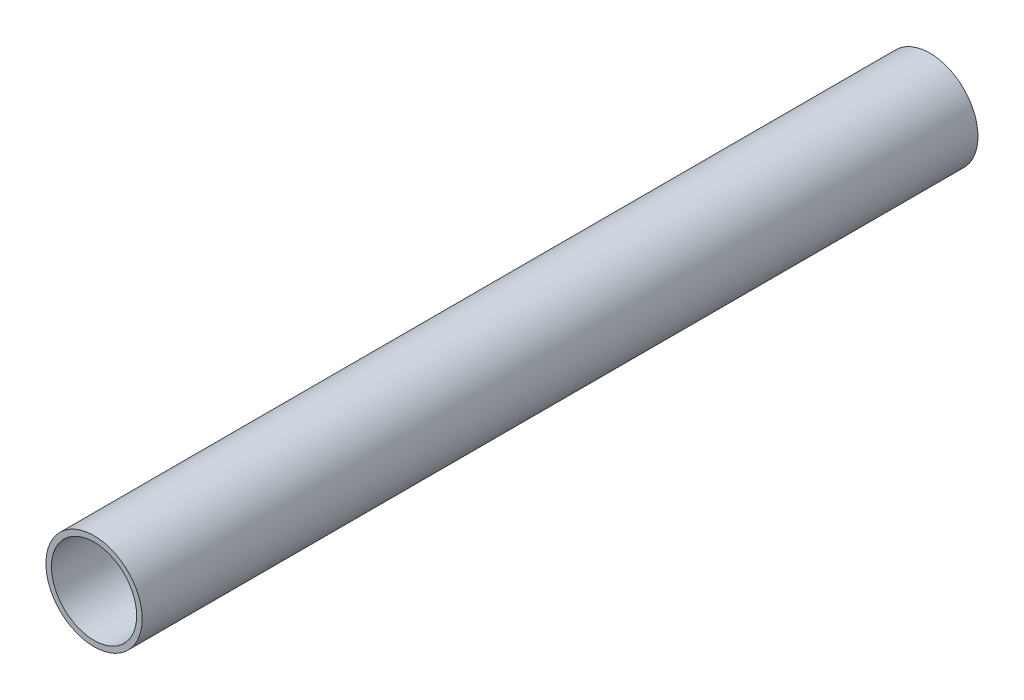
ISO-10303-21;
HEADER;
FILE_DESCRIPTION(('STEP AP214'),'2;1');
FILE_NAME('part.step','',(''),(''),'','','');
FILE_SCHEMA(('AUTOMOTIVE_DESIGN { 1 0 10303 214 1 1 1 1 }'));
ENDSEC;
DATA;
#1=APPLICATION_CONTEXT('core data for automotive mechanical design processes');
#2=APPLICATION_PROTOCOL_DEFINITION('international standard','automotive_design',2000,#1);
#3=PRODUCT_CONTEXT('',#1,'mechanical');
#4=PRODUCT('Part','Part','',(#3));
#5=PRODUCT_RELATED_PRODUCT_CATEGORY('part','',(#4));
#6=PRODUCT_DEFINITION_FORMATION('','',#4);
#7=PRODUCT_DEFINITION_CONTEXT('part definition',#1,'design');
#8=PRODUCT_DEFINITION('design','',#6,#7);
#9=PRODUCT_DEFINITION_SHAPE('','',#8);
#10=(LENGTH_UNIT() NAMED_UNIT(*) SI_UNIT(.MILLI.,.METRE.));
#11=(NAMED_UNIT(*) PLANE_ANGLE_UNIT() SI_UNIT($,.RADIAN.));
#12=(NAMED_UNIT(*) SI_UNIT($,.STERADIAN.) SOLID_ANGLE_UNIT());
#13=UNCERTAINTY_MEASURE_WITH_UNIT(LENGTH_MEASURE(1.E-05),#10,'distance_accuracy_value','');
#14=(GEOMETRIC_REPRESENTATION_CONTEXT(3) GLOBAL_UNCERTAINTY_ASSIGNED_CONTEXT((#13)) GLOBAL_UNIT_ASSIGNED_CONTEXT((#10,
#11,#12)) REPRESENTATION_CONTEXT('',''));
#15=CARTESIAN_POINT('',(0.,0.,0.));
#16=DIRECTION('',(0.,0.,1.));
#17=DIRECTION('',(1.,0.,0.));
#18=AXIS2_PLACEMENT_3D('',#15,#16,#17);
#19=CARTESIAN_POINT('',(0.,0.,455.));
#20=DIRECTION('',(0.,0.,1.));
#21=DIRECTION('',(1.,0.,0.));
#22=AXIS2_PLACEMENT_3D('',#19,#20,#21);
#23=PLANE('',#22);
#24=CARTESIAN_POINT('',(0.,0.,455.));
#25=DIRECTION('',(0.,0.,1.));
#26=DIRECTION('',(1.,0.,0.));
#27=AXIS2_PLACEMENT_3D('',#24,#25,#26);
#28=CIRCLE('',#27,26.2);
#29=CARTESIAN_POINT('',(26.2,0.,455.));
#30=VERTEX_POINT('',#29);
#31=EDGE_CURVE('E10',#30,#30,#28,.T.);
#32=ORIENTED_EDGE('',*,*,#31,.T.);
#33=EDGE_LOOP('',(#32));
#34=FACE_BOUND('',#33,.T.);
#35=CARTESIAN_POINT('',(0.,0.,455.));
#36=DIRECTION('',(0.,0.,1.));
#37=DIRECTION('',(1.,0.,0.));
#38=AXIS2_PLACEMENT_3D('',#35,#36,#37);
#39=CIRCLE('',#38,23.2);
#40=CARTESIAN_POINT('',(23.2,0.,455.));
#41=VERTEX_POINT('',#40);
#42=EDGE_CURVE('E48',#41,#41,#39,.T.);
#43=ORIENTED_EDGE('',*,*,#42,.F.);
#44=EDGE_LOOP('',(#43));
#45=FACE_BOUND('',#44,.T.);
#46=ADVANCED_FACE('F37',(#34,#45),#23,.T.);
#47=CARTESIAN_POINT('',(0.,0.,0.));
#48=DIRECTION('',(0.,0.,1.));
#49=DIRECTION('',(1.,0.,0.));
#50=AXIS2_PLACEMENT_3D('',#47,#48,#49);
#51=PLANE('',#50);
#52=CARTESIAN_POINT('',(0.,0.,0.));
#53=DIRECTION('',(0.,0.,1.));
#54=DIRECTION('',(1.,0.,0.));
#55=AXIS2_PLACEMENT_3D('',#52,#53,#54);
#56=CIRCLE('',#55,26.2);
#57=CARTESIAN_POINT('',(26.2,0.,0.));
#58=VERTEX_POINT('',#57);
#59=EDGE_CURVE('E41',#58,#58,#56,.T.);
#60=ORIENTED_EDGE('',*,*,#59,.F.);
#61=EDGE_LOOP('',(#60));
#62=FACE_BOUND('',#61,.T.);
#63=CARTESIAN_POINT('',(0.,0.,0.));
#64=DIRECTION('',(0.,0.,1.));
#65=DIRECTION('',(1.,0.,0.));
#66=AXIS2_PLACEMENT_3D('',#63,#64,#65);
#67=CIRCLE('',#66,23.2);
#68=CARTESIAN_POINT('',(23.2,0.,0.));
#69=VERTEX_POINT('',#68);
#70=EDGE_CURVE('E50',#69,#69,#67,.T.);
#71=ORIENTED_EDGE('',*,*,#70,.T.);
#72=EDGE_LOOP('',(#71));
#73=FACE_BOUND('',#72,.T.);
#74=ADVANCED_FACE('F60',(#62,#73),#51,.F.);
#75=CARTESIAN_POINT('',(0.,0.,455.));
#76=DIRECTION('',(0.,0.,-1.));
#77=DIRECTION('',(-1.,0.,0.));
#78=AXIS2_PLACEMENT_3D('',#75,#76,#77);
#79=CYLINDRICAL_SURFACE('',#78,26.2);
#80=ORIENTED_EDGE('',*,*,#31,.F.);
#81=EDGE_LOOP('',(#80));
#82=FACE_BOUND('',#81,.T.);
#83=ORIENTED_EDGE('',*,*,#59,.T.);
#84=EDGE_LOOP('',(#83));
#85=FACE_BOUND('',#84,.T.);
#86=ADVANCED_FACE('F39',(#82,#85),#79,.T.);
#87=CARTESIAN_POINT('',(0.,0.,455.));
#88=DIRECTION('',(0.,0.,-1.));
#89=DIRECTION('',(-1.,0.,0.));
#90=AXIS2_PLACEMENT_3D('',#87,#88,#89);
#91=CYLINDRICAL_SURFACE('',#90,23.2);
#92=ORIENTED_EDGE('',*,*,#42,.T.);
#93=EDGE_LOOP('',(#92));
#94=FACE_BOUND('',#93,.T.);
#95=ORIENTED_EDGE('',*,*,#70,.F.);
#96=EDGE_LOOP('',(#95));
#97=FACE_BOUND('',#96,.T.);
#98=ADVANCED_FACE('F56',(#94,#97),#91,.F.);
#99=CLOSED_SHELL('',(#46,#74,#86,#98));
#100=MANIFOLD_SOLID_BREP('B2',#99);
#101=ADVANCED_BREP_SHAPE_REPRESENTATION('',(#18,#100),#14);
#102=SHAPE_DEFINITION_REPRESENTATION(#9,#101);
ENDSEC;
END-ISO-10303-21;
